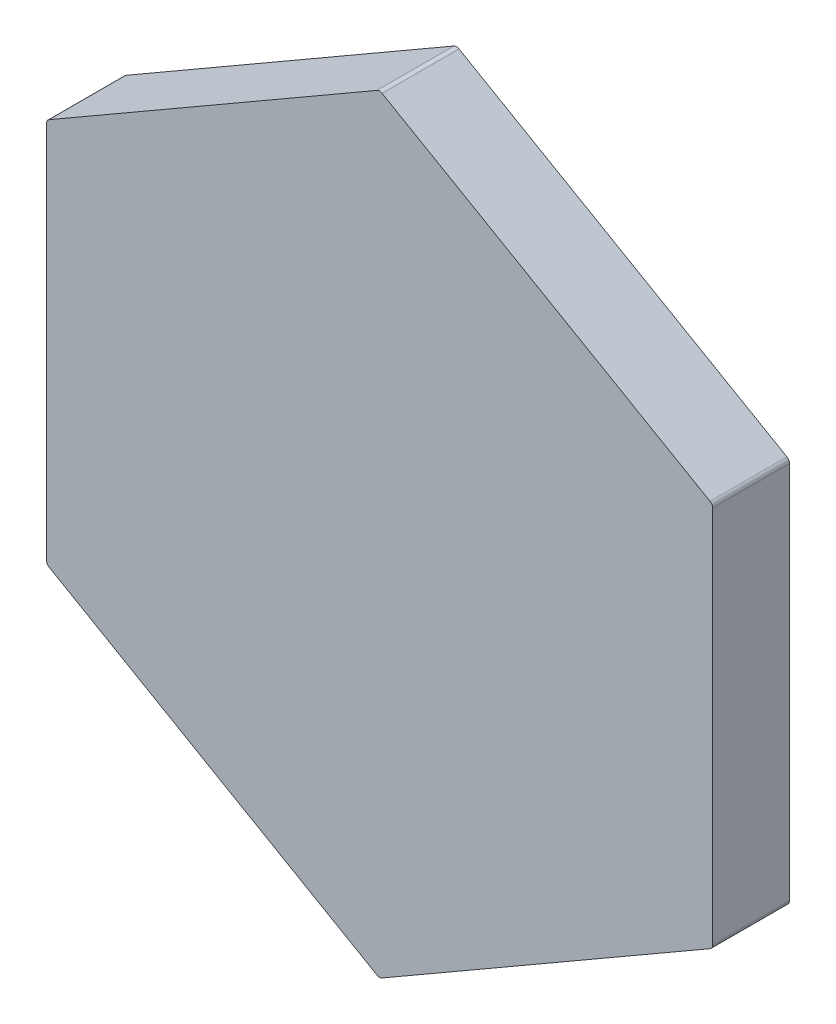
ISO-10303-21;
HEADER;
FILE_DESCRIPTION(('STEP AP214'),'2;1');
FILE_NAME('part.step','',(''),(''),'','','');
FILE_SCHEMA(('AUTOMOTIVE_DESIGN { 1 0 10303 214 1 1 1 1 }'));
ENDSEC;
DATA;
#1=APPLICATION_CONTEXT('core data for automotive mechanical design processes');
#2=APPLICATION_PROTOCOL_DEFINITION('international standard','automotive_design',2000,#1);
#3=PRODUCT_CONTEXT('',#1,'mechanical');
#4=PRODUCT('Part','Part','',(#3));
#5=PRODUCT_RELATED_PRODUCT_CATEGORY('part','',(#4));
#6=PRODUCT_DEFINITION_FORMATION('','',#4);
#7=PRODUCT_DEFINITION_CONTEXT('part definition',#1,'design');
#8=PRODUCT_DEFINITION('design','',#6,#7);
#9=PRODUCT_DEFINITION_SHAPE('','',#8);
#10=(LENGTH_UNIT() NAMED_UNIT(*) SI_UNIT(.MILLI.,.METRE.));
#11=(NAMED_UNIT(*) PLANE_ANGLE_UNIT() SI_UNIT($,.RADIAN.));
#12=(NAMED_UNIT(*) SI_UNIT($,.STERADIAN.) SOLID_ANGLE_UNIT());
#13=UNCERTAINTY_MEASURE_WITH_UNIT(LENGTH_MEASURE(1.E-05),#10,'distance_accuracy_value','');
#14=(GEOMETRIC_REPRESENTATION_CONTEXT(3) GLOBAL_UNCERTAINTY_ASSIGNED_CONTEXT((#13)) GLOBAL_UNIT_ASSIGNED_CONTEXT((#10,
#11,#12)) REPRESENTATION_CONTEXT('',''));
#15=CARTESIAN_POINT('',(0.,0.,0.));
#16=DIRECTION('',(0.,0.,1.));
#17=DIRECTION('',(1.,0.,0.));
#18=AXIS2_PLACEMENT_3D('',#15,#16,#17);
#19=CARTESIAN_POINT('',(-64.951905283833,-300.,85.));
#20=DIRECTION('',(0.,0.,1.));
#21=DIRECTION('',(-0.5,0.866025403784438,0.));
#22=AXIS2_PLACEMENT_3D('',#19,#20,#21);
#23=PLANE('',#22);
#24=CARTESIAN_POINT('',(-64.951905283833,-373.845299461621,85.));
#25=DIRECTION('',(0.,0.,-1.));
#26=DIRECTION('',(0.,-0.999999999999999,0.));
#27=AXIS2_PLACEMENT_3D('',#24,#25,#26);
#28=CIRCLE('',#27,1.);
#29=CARTESIAN_POINT('',(-64.451905283833,-374.711324865405,85.));
#30=VERTEX_POINT('',#29);
#31=CARTESIAN_POINT('',(-65.451905283833,-374.711324865405,85.));
#32=VERTEX_POINT('',#31);
#33=EDGE_CURVE('E197',#30,#32,#28,.T.);
#34=ORIENTED_EDGE('',*,*,#33,.F.);
#35=DIRECTION('',(0.866025403784439,0.5,0.));
#36=VECTOR('',#35,1.);
#37=CARTESIAN_POINT('',(-64.951905283833,-375.,85.));
#38=LINE('',#37,#36);
#39=CARTESIAN_POINT('',(-0.500000000000167,-337.788675134595,85.));
#40=VERTEX_POINT('',#39);
#41=EDGE_CURVE('E185',#30,#40,#38,.T.);
#42=ORIENTED_EDGE('',*,*,#41,.T.);
#43=CARTESIAN_POINT('',(-1.00000000000017,-336.92264973081,85.));
#44=DIRECTION('',(0.,0.,-1.));
#45=DIRECTION('',(0.866025403784438,-0.499999999999999,0.));
#46=AXIS2_PLACEMENT_3D('',#43,#44,#45);
#47=CIRCLE('',#46,1.);
#48=CARTESIAN_POINT('',(0.,-336.92264973081,85.));
#49=VERTEX_POINT('',#48);
#50=EDGE_CURVE('E206',#49,#40,#47,.T.);
#51=ORIENTED_EDGE('',*,*,#50,.F.);
#52=DIRECTION('',(0.,1.,0.));
#53=VECTOR('',#52,1.);
#54=CARTESIAN_POINT('',(0.,-337.5,85.));
#55=LINE('',#54,#53);
#56=CARTESIAN_POINT('',(0.,-263.07735026919,85.));
#57=VERTEX_POINT('',#56);
#58=EDGE_CURVE('E42',#49,#57,#55,.T.);
#59=ORIENTED_EDGE('',*,*,#58,.T.);
#60=CARTESIAN_POINT('',(-1.00000000000006,-263.07735026919,85.));
#61=DIRECTION('',(0.,0.,-1.));
#62=DIRECTION('',(0.866025403784438,0.500000000000001,0.));
#63=AXIS2_PLACEMENT_3D('',#60,#61,#62);
#64=CIRCLE('',#63,1.);
#65=CARTESIAN_POINT('',(-0.500000000000084,-262.211324865405,85.));
#66=VERTEX_POINT('',#65);
#67=EDGE_CURVE('E179',#66,#57,#64,.T.);
#68=ORIENTED_EDGE('',*,*,#67,.F.);
#69=DIRECTION('',(-0.866025403784439,0.5,0.));
#70=VECTOR('',#69,1.);
#71=CARTESIAN_POINT('',(0.,-262.5,85.));
#72=LINE('',#71,#70);
#73=CARTESIAN_POINT('',(-64.4519052838329,-225.288675134595,85.));
#74=VERTEX_POINT('',#73);
#75=EDGE_CURVE('E216',#66,#74,#72,.T.);
#76=ORIENTED_EDGE('',*,*,#75,.T.);
#77=CARTESIAN_POINT('',(-64.951905283833,-226.154700538379,85.));
#78=DIRECTION('',(0.,0.,-1.));
#79=DIRECTION('',(0.,0.999999999999998,0.));
#80=AXIS2_PLACEMENT_3D('',#77,#78,#79);
#81=CIRCLE('',#80,1.);
#82=CARTESIAN_POINT('',(-65.451905283833,-225.288675134595,85.));
#83=VERTEX_POINT('',#82);
#84=EDGE_CURVE('E163',#83,#74,#81,.T.);
#85=ORIENTED_EDGE('',*,*,#84,.F.);
#86=DIRECTION('',(-0.866025403784439,-0.5,0.));
#87=VECTOR('',#86,1.);
#88=CARTESIAN_POINT('',(-64.951905283833,-225.,85.));
#89=LINE('',#88,#87);
#90=CARTESIAN_POINT('',(-129.403810567666,-262.211324865405,85.));
#91=VERTEX_POINT('',#90);
#92=EDGE_CURVE('E11',#83,#91,#89,.T.);
#93=ORIENTED_EDGE('',*,*,#92,.T.);
#94=CARTESIAN_POINT('',(-128.903810567666,-263.07735026919,85.));
#95=DIRECTION('',(0.,0.,-1.));
#96=DIRECTION('',(-0.866025403784438,0.499999999999999,0.));
#97=AXIS2_PLACEMENT_3D('',#94,#95,#96);
#98=CIRCLE('',#97,1.);
#99=CARTESIAN_POINT('',(-129.903810567666,-263.07735026919,85.));
#100=VERTEX_POINT('',#99);
#101=EDGE_CURVE('E227',#100,#91,#98,.T.);
#102=ORIENTED_EDGE('',*,*,#101,.F.);
#103=DIRECTION('',(0.,-1.,0.));
#104=VECTOR('',#103,1.);
#105=CARTESIAN_POINT('',(-129.903810567666,-262.5,85.));
#106=LINE('',#105,#104);
#107=CARTESIAN_POINT('',(-129.903810567666,-336.92264973081,85.));
#108=VERTEX_POINT('',#107);
#109=EDGE_CURVE('E146',#100,#108,#106,.T.);
#110=ORIENTED_EDGE('',*,*,#109,.T.);
#111=CARTESIAN_POINT('',(-128.903810567666,-336.92264973081,85.));
#112=DIRECTION('',(0.,0.,-1.));
#113=DIRECTION('',(-0.866025403784439,-0.5,0.));
#114=AXIS2_PLACEMENT_3D('',#111,#112,#113);
#115=CIRCLE('',#114,1.);
#116=CARTESIAN_POINT('',(-129.403810567666,-337.788675134595,85.));
#117=VERTEX_POINT('',#116);
#118=EDGE_CURVE('E141',#117,#108,#115,.T.);
#119=ORIENTED_EDGE('',*,*,#118,.F.);
#120=DIRECTION('',(0.866025403784439,-0.5,0.));
#121=VECTOR('',#120,1.);
#122=CARTESIAN_POINT('',(-129.903810567666,-337.5,85.));
#123=LINE('',#122,#121);
#124=EDGE_CURVE('E28',#117,#32,#123,.T.);
#125=ORIENTED_EDGE('',*,*,#124,.T.);
#126=EDGE_LOOP('',(#34,#42,#51,#59,#68,#76,#85,#93,#102,#110,#119,#125));
#127=FACE_BOUND('',#126,.T.);
#128=ADVANCED_FACE('F17',(#127),#23,.T.);
#129=CARTESIAN_POINT('',(-64.951905283833,-225.,70.));
#130=DIRECTION('',(-0.5,0.866025403784439,0.));
#131=DIRECTION('',(0.866025403784439,0.5,0.));
#132=AXIS2_PLACEMENT_3D('',#129,#130,#131);
#133=PLANE('',#132);
#134=DIRECTION('',(0.,0.,-1.));
#135=VECTOR('',#134,1.);
#136=CARTESIAN_POINT('',(-129.403810567666,-262.211324865405,70.));
#137=LINE('',#136,#135);
#138=CARTESIAN_POINT('',(-129.403810567666,-262.211324865405,70.));
#139=VERTEX_POINT('',#138);
#140=EDGE_CURVE('E168',#91,#139,#137,.T.);
#141=ORIENTED_EDGE('',*,*,#140,.F.);
#142=ORIENTED_EDGE('',*,*,#92,.F.);
#143=DIRECTION('',(0.,0.,1.));
#144=VECTOR('',#143,1.);
#145=CARTESIAN_POINT('',(-65.451905283833,-225.288675134595,70.));
#146=LINE('',#145,#144);
#147=CARTESIAN_POINT('',(-65.451905283833,-225.288675134595,70.));
#148=VERTEX_POINT('',#147);
#149=EDGE_CURVE('E220',#148,#83,#146,.T.);
#150=ORIENTED_EDGE('',*,*,#149,.F.);
#151=DIRECTION('',(-0.866025403784439,-0.5,0.));
#152=VECTOR('',#151,1.);
#153=CARTESIAN_POINT('',(-64.951905283833,-225.,70.));
#154=LINE('',#153,#152);
#155=EDGE_CURVE('E178',#148,#139,#154,.T.);
#156=ORIENTED_EDGE('',*,*,#155,.T.);
#157=EDGE_LOOP('',(#141,#142,#150,#156));
#158=FACE_BOUND('',#157,.T.);
#159=ADVANCED_FACE('F252',(#158),#133,.T.);
#160=CARTESIAN_POINT('',(-129.903810567666,-337.5,70.));
#161=DIRECTION('',(-0.5,-0.866025403784439,0.));
#162=DIRECTION('',(0.,0.,1.));
#163=AXIS2_PLACEMENT_3D('',#160,#161,#162);
#164=PLANE('',#163);
#165=DIRECTION('',(0.,0.,-1.));
#166=VECTOR('',#165,1.);
#167=CARTESIAN_POINT('',(-65.451905283833,-374.711324865405,70.));
#168=LINE('',#167,#166);
#169=CARTESIAN_POINT('',(-65.451905283833,-374.711324865405,70.));
#170=VERTEX_POINT('',#169);
#171=EDGE_CURVE('E132',#32,#170,#168,.T.);
#172=ORIENTED_EDGE('',*,*,#171,.F.);
#173=ORIENTED_EDGE('',*,*,#124,.F.);
#174=DIRECTION('',(0.,0.,1.));
#175=VECTOR('',#174,1.);
#176=CARTESIAN_POINT('',(-129.403810567666,-337.788675134595,70.));
#177=LINE('',#176,#175);
#178=CARTESIAN_POINT('',(-129.403810567666,-337.788675134595,70.));
#179=VERTEX_POINT('',#178);
#180=EDGE_CURVE('E129',#179,#117,#177,.T.);
#181=ORIENTED_EDGE('',*,*,#180,.F.);
#182=DIRECTION('',(0.866025403784439,-0.5,0.));
#183=VECTOR('',#182,1.);
#184=CARTESIAN_POINT('',(-129.903810567666,-337.5,70.));
#185=LINE('',#184,#183);
#186=EDGE_CURVE('E189',#179,#170,#185,.T.);
#187=ORIENTED_EDGE('',*,*,#186,.T.);
#188=EDGE_LOOP('',(#172,#173,#181,#187));
#189=FACE_BOUND('',#188,.T.);
#190=ADVANCED_FACE('F128',(#189),#164,.T.);
#191=CARTESIAN_POINT('',(0.,-337.5,70.));
#192=DIRECTION('',(1.,0.,0.));
#193=DIRECTION('',(0.,-1.,0.));
#194=AXIS2_PLACEMENT_3D('',#191,#192,#193);
#195=PLANE('',#194);
#196=DIRECTION('',(0.,0.,-1.));
#197=VECTOR('',#196,1.);
#198=CARTESIAN_POINT('',(0.,-263.07735026919,70.));
#199=LINE('',#198,#197);
#200=CARTESIAN_POINT('',(0.,-263.07735026919,70.));
#201=VERTEX_POINT('',#200);
#202=EDGE_CURVE('E183',#57,#201,#199,.T.);
#203=ORIENTED_EDGE('',*,*,#202,.F.);
#204=ORIENTED_EDGE('',*,*,#58,.F.);
#205=DIRECTION('',(0.,0.,1.));
#206=VECTOR('',#205,1.);
#207=CARTESIAN_POINT('',(0.,-336.92264973081,70.));
#208=LINE('',#207,#206);
#209=CARTESIAN_POINT('',(0.,-336.92264973081,70.));
#210=VERTEX_POINT('',#209);
#211=EDGE_CURVE('E120',#210,#49,#208,.T.);
#212=ORIENTED_EDGE('',*,*,#211,.F.);
#213=DIRECTION('',(0.,1.,0.));
#214=VECTOR('',#213,1.);
#215=CARTESIAN_POINT('',(0.,-337.5,70.));
#216=LINE('',#215,#214);
#217=EDGE_CURVE('E159',#210,#201,#216,.T.);
#218=ORIENTED_EDGE('',*,*,#217,.T.);
#219=EDGE_LOOP('',(#203,#204,#212,#218));
#220=FACE_BOUND('',#219,.T.);
#221=ADVANCED_FACE('F446',(#220),#195,.T.);
#222=CARTESIAN_POINT('',(-1.00000000000017,-336.92264973081,70.));
#223=DIRECTION('',(0.,0.,1.));
#224=DIRECTION('',(0.866025403784438,-0.499999999999999,0.));
#225=AXIS2_PLACEMENT_3D('',#222,#223,#224);
#226=CYLINDRICAL_SURFACE('',#225,1.);
#227=ORIENTED_EDGE('',*,*,#50,.T.);
#228=DIRECTION('',(0.,0.,-1.));
#229=VECTOR('',#228,1.);
#230=CARTESIAN_POINT('',(-0.500000000000167,-337.788675134595,70.));
#231=LINE('',#230,#229);
#232=CARTESIAN_POINT('',(-0.500000000000167,-337.788675134595,70.));
#233=VERTEX_POINT('',#232);
#234=EDGE_CURVE('E190',#40,#233,#231,.T.);
#235=ORIENTED_EDGE('',*,*,#234,.T.);
#236=CARTESIAN_POINT('',(-1.00000000000017,-336.92264973081,70.));
#237=DIRECTION('',(0.,0.,1.));
#238=DIRECTION('',(0.866025403784438,-0.499999999999999,0.));
#239=AXIS2_PLACEMENT_3D('',#236,#237,#238);
#240=CIRCLE('',#239,1.);
#241=EDGE_CURVE('E152',#233,#210,#240,.T.);
#242=ORIENTED_EDGE('',*,*,#241,.T.);
#243=ORIENTED_EDGE('',*,*,#211,.T.);
#244=EDGE_LOOP('',(#227,#235,#242,#243));
#245=FACE_BOUND('',#244,.T.);
#246=ADVANCED_FACE('F296',(#245),#226,.T.);
#247=CARTESIAN_POINT('',(-1.00000000000006,-263.07735026919,70.));
#248=DIRECTION('',(0.,0.,1.));
#249=DIRECTION('',(0.866025403784438,0.500000000000001,0.));
#250=AXIS2_PLACEMENT_3D('',#247,#248,#249);
#251=CYLINDRICAL_SURFACE('',#250,1.);
#252=ORIENTED_EDGE('',*,*,#67,.T.);
#253=ORIENTED_EDGE('',*,*,#202,.T.);
#254=CARTESIAN_POINT('',(-1.00000000000006,-263.07735026919,70.));
#255=DIRECTION('',(0.,0.,1.));
#256=DIRECTION('',(0.866025403784438,0.500000000000001,0.));
#257=AXIS2_PLACEMENT_3D('',#254,#255,#256);
#258=CIRCLE('',#257,1.);
#259=CARTESIAN_POINT('',(-0.500000000000084,-262.211324865405,70.));
#260=VERTEX_POINT('',#259);
#261=EDGE_CURVE('E169',#201,#260,#258,.T.);
#262=ORIENTED_EDGE('',*,*,#261,.T.);
#263=DIRECTION('',(0.,0.,1.));
#264=VECTOR('',#263,1.);
#265=CARTESIAN_POINT('',(-0.500000000000084,-262.211324865405,70.));
#266=LINE('',#265,#264);
#267=EDGE_CURVE('E184',#260,#66,#266,.T.);
#268=ORIENTED_EDGE('',*,*,#267,.T.);
#269=EDGE_LOOP('',(#252,#253,#262,#268));
#270=FACE_BOUND('',#269,.T.);
#271=ADVANCED_FACE('F488',(#270),#251,.T.);
#272=CARTESIAN_POINT('',(0.,-262.5,70.));
#273=DIRECTION('',(0.5,0.866025403784439,0.));
#274=DIRECTION('',(0.,0.,-1.));
#275=AXIS2_PLACEMENT_3D('',#272,#273,#274);
#276=PLANE('',#275);
#277=DIRECTION('',(0.,0.,-1.));
#278=VECTOR('',#277,1.);
#279=CARTESIAN_POINT('',(-64.4519052838329,-225.288675134595,70.));
#280=LINE('',#279,#278);
#281=CARTESIAN_POINT('',(-64.4519052838329,-225.288675134595,70.));
#282=VERTEX_POINT('',#281);
#283=EDGE_CURVE('E167',#74,#282,#280,.T.);
#284=ORIENTED_EDGE('',*,*,#283,.F.);
#285=ORIENTED_EDGE('',*,*,#75,.F.);
#286=ORIENTED_EDGE('',*,*,#267,.F.);
#287=DIRECTION('',(-0.866025403784439,0.5,0.));
#288=VECTOR('',#287,1.);
#289=CARTESIAN_POINT('',(0.,-262.5,70.));
#290=LINE('',#289,#288);
#291=EDGE_CURVE('E173',#260,#282,#290,.T.);
#292=ORIENTED_EDGE('',*,*,#291,.T.);
#293=EDGE_LOOP('',(#284,#285,#286,#292));
#294=FACE_BOUND('',#293,.T.);
#295=ADVANCED_FACE('F242',(#294),#276,.T.);
#296=CARTESIAN_POINT('',(-64.951905283833,-226.154700538379,70.));
#297=DIRECTION('',(0.,0.,1.));
#298=DIRECTION('',(0.,0.999999999999998,0.));
#299=AXIS2_PLACEMENT_3D('',#296,#297,#298);
#300=CYLINDRICAL_SURFACE('',#299,1.);
#301=ORIENTED_EDGE('',*,*,#84,.T.);
#302=ORIENTED_EDGE('',*,*,#283,.T.);
#303=CARTESIAN_POINT('',(-64.951905283833,-226.154700538379,70.));
#304=DIRECTION('',(0.,0.,1.));
#305=DIRECTION('',(0.,0.999999999999998,0.));
#306=AXIS2_PLACEMENT_3D('',#303,#304,#305);
#307=CIRCLE('',#306,1.);
#308=EDGE_CURVE('E174',#282,#148,#307,.T.);
#309=ORIENTED_EDGE('',*,*,#308,.T.);
#310=ORIENTED_EDGE('',*,*,#149,.T.);
#311=EDGE_LOOP('',(#301,#302,#309,#310));
#312=FACE_BOUND('',#311,.T.);
#313=ADVANCED_FACE('F233',(#312),#300,.T.);
#314=CARTESIAN_POINT('',(-128.903810567666,-263.07735026919,70.));
#315=DIRECTION('',(0.,0.,1.));
#316=DIRECTION('',(-0.866025403784438,0.499999999999999,0.));
#317=AXIS2_PLACEMENT_3D('',#314,#315,#316);
#318=CYLINDRICAL_SURFACE('',#317,1.);
#319=ORIENTED_EDGE('',*,*,#101,.T.);
#320=ORIENTED_EDGE('',*,*,#140,.T.);
#321=CARTESIAN_POINT('',(-128.903810567666,-263.07735026919,70.));
#322=DIRECTION('',(0.,0.,1.));
#323=DIRECTION('',(-0.866025403784438,0.499999999999999,0.));
#324=AXIS2_PLACEMENT_3D('',#321,#322,#323);
#325=CIRCLE('',#324,1.);
#326=CARTESIAN_POINT('',(-129.903810567666,-263.07735026919,70.));
#327=VERTEX_POINT('',#326);
#328=EDGE_CURVE('E205',#139,#327,#325,.T.);
#329=ORIENTED_EDGE('',*,*,#328,.T.);
#330=DIRECTION('',(0.,0.,1.));
#331=VECTOR('',#330,1.);
#332=CARTESIAN_POINT('',(-129.903810567666,-263.07735026919,70.));
#333=LINE('',#332,#331);
#334=EDGE_CURVE('E268',#327,#100,#333,.T.);
#335=ORIENTED_EDGE('',*,*,#334,.T.);
#336=EDGE_LOOP('',(#319,#320,#329,#335));
#337=FACE_BOUND('',#336,.T.);
#338=ADVANCED_FACE('F465',(#337),#318,.T.);
#339=CARTESIAN_POINT('',(-129.903810567666,-262.5,70.));
#340=DIRECTION('',(-1.,0.,0.));
#341=DIRECTION('',(0.,0.,-1.));
#342=AXIS2_PLACEMENT_3D('',#339,#340,#341);
#343=PLANE('',#342);
#344=DIRECTION('',(0.,0.,-1.));
#345=VECTOR('',#344,1.);
#346=CARTESIAN_POINT('',(-129.903810567666,-336.92264973081,70.));
#347=LINE('',#346,#345);
#348=CARTESIAN_POINT('',(-129.903810567666,-336.92264973081,70.));
#349=VERTEX_POINT('',#348);
#350=EDGE_CURVE('E147',#108,#349,#347,.T.);
#351=ORIENTED_EDGE('',*,*,#350,.F.);
#352=ORIENTED_EDGE('',*,*,#109,.F.);
#353=ORIENTED_EDGE('',*,*,#334,.F.);
#354=DIRECTION('',(0.,-1.,0.));
#355=VECTOR('',#354,1.);
#356=CARTESIAN_POINT('',(-129.903810567666,-262.5,70.));
#357=LINE('',#356,#355);
#358=EDGE_CURVE('E209',#327,#349,#357,.T.);
#359=ORIENTED_EDGE('',*,*,#358,.T.);
#360=EDGE_LOOP('',(#351,#352,#353,#359));
#361=FACE_BOUND('',#360,.T.);
#362=ADVANCED_FACE('F443',(#361),#343,.T.);
#363=CARTESIAN_POINT('',(-128.903810567666,-336.92264973081,70.));
#364=DIRECTION('',(0.,0.,1.));
#365=DIRECTION('',(-0.866025403784439,-0.5,0.));
#366=AXIS2_PLACEMENT_3D('',#363,#364,#365);
#367=CYLINDRICAL_SURFACE('',#366,1.);
#368=ORIENTED_EDGE('',*,*,#118,.T.);
#369=ORIENTED_EDGE('',*,*,#350,.T.);
#370=CARTESIAN_POINT('',(-128.903810567666,-336.92264973081,70.));
#371=DIRECTION('',(0.,0.,1.));
#372=DIRECTION('',(-0.866025403784439,-0.5,0.));
#373=AXIS2_PLACEMENT_3D('',#370,#371,#372);
#374=CIRCLE('',#373,1.);
#375=EDGE_CURVE('E143',#349,#179,#374,.T.);
#376=ORIENTED_EDGE('',*,*,#375,.T.);
#377=ORIENTED_EDGE('',*,*,#180,.T.);
#378=EDGE_LOOP('',(#368,#369,#376,#377));
#379=FACE_BOUND('',#378,.T.);
#380=ADVANCED_FACE('F19',(#379),#367,.T.);
#381=CARTESIAN_POINT('',(-64.951905283833,-300.,70.));
#382=DIRECTION('',(0.,0.,1.));
#383=DIRECTION('',(-0.5,0.866025403784438,0.));
#384=AXIS2_PLACEMENT_3D('',#381,#382,#383);
#385=PLANE('',#384);
#386=CARTESIAN_POINT('',(-64.951905283833,-373.845299461621,70.));
#387=DIRECTION('',(0.,0.,1.));
#388=DIRECTION('',(0.,-0.999999999999999,0.));
#389=AXIS2_PLACEMENT_3D('',#386,#387,#388);
#390=CIRCLE('',#389,1.);
#391=CARTESIAN_POINT('',(-64.451905283833,-374.711324865405,70.));
#392=VERTEX_POINT('',#391);
#393=EDGE_CURVE('E196',#170,#392,#390,.T.);
#394=ORIENTED_EDGE('',*,*,#393,.F.);
#395=ORIENTED_EDGE('',*,*,#186,.F.);
#396=ORIENTED_EDGE('',*,*,#375,.F.);
#397=ORIENTED_EDGE('',*,*,#358,.F.);
#398=ORIENTED_EDGE('',*,*,#328,.F.);
#399=ORIENTED_EDGE('',*,*,#155,.F.);
#400=ORIENTED_EDGE('',*,*,#308,.F.);
#401=ORIENTED_EDGE('',*,*,#291,.F.);
#402=ORIENTED_EDGE('',*,*,#261,.F.);
#403=ORIENTED_EDGE('',*,*,#217,.F.);
#404=ORIENTED_EDGE('',*,*,#241,.F.);
#405=DIRECTION('',(0.866025403784439,0.5,0.));
#406=VECTOR('',#405,1.);
#407=CARTESIAN_POINT('',(-64.951905283833,-375.,70.));
#408=LINE('',#407,#406);
#409=EDGE_CURVE('E201',#392,#233,#408,.T.);
#410=ORIENTED_EDGE('',*,*,#409,.F.);
#411=EDGE_LOOP('',(#394,#395,#396,#397,#398,#399,#400,#401,#402,#403,#404,#410));
#412=FACE_BOUND('',#411,.T.);
#413=ADVANCED_FACE('F246',(#412),#385,.F.);
#414=CARTESIAN_POINT('',(-64.951905283833,-375.,70.));
#415=DIRECTION('',(0.5,-0.866025403784439,0.));
#416=DIRECTION('',(0.,0.,1.));
#417=AXIS2_PLACEMENT_3D('',#414,#415,#416);
#418=PLANE('',#417);
#419=DIRECTION('',(0.,0.,1.));
#420=VECTOR('',#419,1.);
#421=CARTESIAN_POINT('',(-64.451905283833,-374.711324865405,70.));
#422=LINE('',#421,#420);
#423=EDGE_CURVE('E21',#392,#30,#422,.T.);
#424=ORIENTED_EDGE('',*,*,#423,.F.);
#425=ORIENTED_EDGE('',*,*,#409,.T.);
#426=ORIENTED_EDGE('',*,*,#234,.F.);
#427=ORIENTED_EDGE('',*,*,#41,.F.);
#428=EDGE_LOOP('',(#424,#425,#426,#427));
#429=FACE_BOUND('',#428,.T.);
#430=ADVANCED_FACE('F294',(#429),#418,.T.);
#431=CARTESIAN_POINT('',(-64.951905283833,-373.845299461621,70.));
#432=DIRECTION('',(0.,0.,1.));
#433=DIRECTION('',(0.,-0.999999999999999,0.));
#434=AXIS2_PLACEMENT_3D('',#431,#432,#433);
#435=CYLINDRICAL_SURFACE('',#434,1.);
#436=ORIENTED_EDGE('',*,*,#33,.T.);
#437=ORIENTED_EDGE('',*,*,#171,.T.);
#438=ORIENTED_EDGE('',*,*,#393,.T.);
#439=ORIENTED_EDGE('',*,*,#423,.T.);
#440=EDGE_LOOP('',(#436,#437,#438,#439));
#441=FACE_BOUND('',#440,.T.);
#442=ADVANCED_FACE('F287',(#441),#435,.T.);
#443=CLOSED_SHELL('',(#128,#159,#190,#221,#246,#271,#295,#313,#338,#362,#380,#413,#430,#442));
#444=MANIFOLD_SOLID_BREP('B1',#443);
#445=ADVANCED_BREP_SHAPE_REPRESENTATION('',(#18,#444),#14);
#446=SHAPE_DEFINITION_REPRESENTATION(#9,#445);
ENDSEC;
END-ISO-10303-21;
